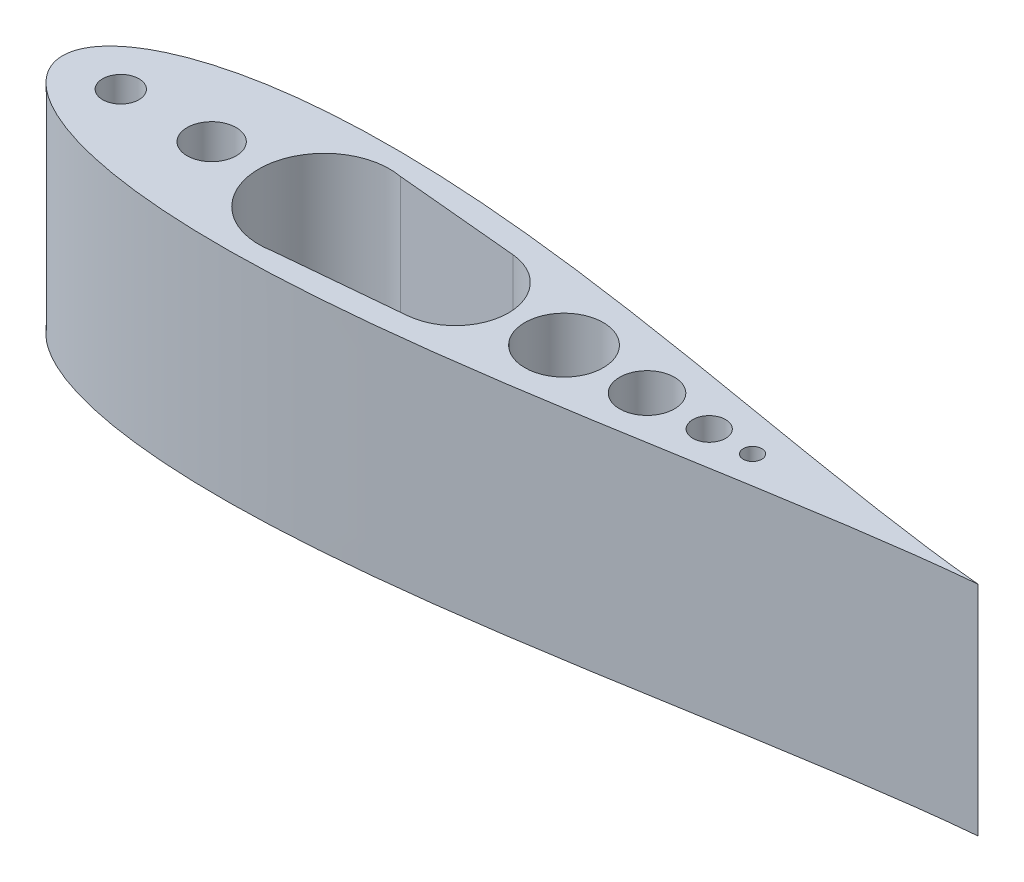
ISO-10303-21;
HEADER;
FILE_DESCRIPTION(('STEP AP214'),'2;1');
FILE_NAME('part.step','',(''),(''),'','','');
FILE_SCHEMA(('AUTOMOTIVE_DESIGN { 1 0 10303 214 1 1 1 1 }'));
ENDSEC;
DATA;
#1=APPLICATION_CONTEXT('core data for automotive mechanical design processes');
#2=APPLICATION_PROTOCOL_DEFINITION('international standard','automotive_design',2000,#1);
#3=PRODUCT_CONTEXT('',#1,'mechanical');
#4=PRODUCT('Part','Part','',(#3));
#5=PRODUCT_RELATED_PRODUCT_CATEGORY('part','',(#4));
#6=PRODUCT_DEFINITION_FORMATION('','',#4);
#7=PRODUCT_DEFINITION_CONTEXT('part definition',#1,'design');
#8=PRODUCT_DEFINITION('design','',#6,#7);
#9=PRODUCT_DEFINITION_SHAPE('','',#8);
#10=(LENGTH_UNIT() NAMED_UNIT(*) SI_UNIT(.MILLI.,.METRE.));
#11=(NAMED_UNIT(*) PLANE_ANGLE_UNIT() SI_UNIT($,.RADIAN.));
#12=(NAMED_UNIT(*) SI_UNIT($,.STERADIAN.) SOLID_ANGLE_UNIT());
#13=UNCERTAINTY_MEASURE_WITH_UNIT(LENGTH_MEASURE(1.E-05),#10,'distance_accuracy_value','');
#14=(GEOMETRIC_REPRESENTATION_CONTEXT(3) GLOBAL_UNCERTAINTY_ASSIGNED_CONTEXT((#13)) GLOBAL_UNIT_ASSIGNED_CONTEXT((#10,
#11,#12)) REPRESENTATION_CONTEXT('',''));
#15=CARTESIAN_POINT('',(0.,0.,0.));
#16=DIRECTION('',(0.,0.,1.));
#17=DIRECTION('',(1.,0.,0.));
#18=AXIS2_PLACEMENT_3D('',#15,#16,#17);
#19=CARTESIAN_POINT('',(-45.5408385930493,50.8,0.));
#20=DIRECTION('',(0.,-1.,0.));
#21=DIRECTION('',(0.,0.,-1.));
#22=AXIS2_PLACEMENT_3D('',#19,#20,#21);
#23=CYLINDRICAL_SURFACE('',#22,15.24);
#24=CARTESIAN_POINT('',(-45.5408385930493,0.,0.));
#25=DIRECTION('',(0.,1.,0.));
#26=DIRECTION('',(0.,0.,1.));
#27=AXIS2_PLACEMENT_3D('',#24,#25,#26);
#28=CIRCLE('',#27,15.24);
#29=CARTESIAN_POINT('',(-42.7235764956563,0.,-14.977337355972));
#30=VERTEX_POINT('',#29);
#31=CARTESIAN_POINT('',(-42.7235764956562,0.,14.9773373559719));
#32=VERTEX_POINT('',#31);
#33=EDGE_CURVE('E156',#30,#32,#28,.T.);
#34=ORIENTED_EDGE('',*,*,#33,.F.);
#35=DIRECTION('',(0.,-1.,0.));
#36=VECTOR('',#35,1.);
#37=CARTESIAN_POINT('',(-42.7235764956563,50.8,-14.977337355972));
#38=LINE('',#37,#36);
#39=CARTESIAN_POINT('',(-42.7235764956563,50.8,-14.977337355972));
#40=VERTEX_POINT('',#39);
#41=EDGE_CURVE('E11',#40,#30,#38,.T.);
#42=ORIENTED_EDGE('',*,*,#41,.F.);
#43=CARTESIAN_POINT('',(-45.5408385930493,50.8,0.));
#44=DIRECTION('',(0.,1.,0.));
#45=DIRECTION('',(0.,0.,1.));
#46=AXIS2_PLACEMENT_3D('',#43,#44,#45);
#47=CIRCLE('',#46,15.24);
#48=CARTESIAN_POINT('',(-42.7235764956562,50.8,14.9773373559719));
#49=VERTEX_POINT('',#48);
#50=EDGE_CURVE('E105',#40,#49,#47,.T.);
#51=ORIENTED_EDGE('',*,*,#50,.T.);
#52=DIRECTION('',(0.,-1.,0.));
#53=VECTOR('',#52,1.);
#54=CARTESIAN_POINT('',(-42.7235764956562,50.8,14.9773373559719));
#55=LINE('',#54,#53);
#56=EDGE_CURVE('E56',#49,#32,#55,.T.);
#57=ORIENTED_EDGE('',*,*,#56,.T.);
#58=EDGE_LOOP('',(#34,#42,#51,#57));
#59=FACE_BOUND('',#58,.T.);
#60=ADVANCED_FACE('F36',(#59),#23,.F.);
#61=CARTESIAN_POINT('',(1.01618101339123,50.8,-10.8993353954501));
#62=DIRECTION('',(0.0928307105141881,0.,-0.995681906627529));
#63=DIRECTION('',(-0.995681906627529,0.,-0.0928307105141881));
#64=AXIS2_PLACEMENT_3D('',#61,#62,#63);
#65=PLANE('',#64);
#66=DIRECTION('',(0.995681906627529,0.,0.0928307105141881));
#67=VECTOR('',#66,1.);
#68=CARTESIAN_POINT('',(1.01618101339123,0.,-10.8993353954501));
#69=LINE('',#68,#67);
#70=CARTESIAN_POINT('',(-13.8473201339051,0.,-12.2851086660576));
#71=VERTEX_POINT('',#70);
#72=EDGE_CURVE('E111',#30,#71,#69,.T.);
#73=ORIENTED_EDGE('',*,*,#72,.T.);
#74=DIRECTION('',(0.,-1.,0.));
#75=VECTOR('',#74,1.);
#76=CARTESIAN_POINT('',(-13.8473201339051,50.8,-12.2851086660576));
#77=LINE('',#76,#75);
#78=CARTESIAN_POINT('',(-13.8473201339051,50.8,-12.2851086660576));
#79=VERTEX_POINT('',#78);
#80=EDGE_CURVE('E47',#79,#71,#77,.T.);
#81=ORIENTED_EDGE('',*,*,#80,.F.);
#82=DIRECTION('',(0.995681906627529,0.,0.0928307105141881));
#83=VECTOR('',#82,1.);
#84=CARTESIAN_POINT('',(1.01618101339123,50.8,-10.8993353954501));
#85=LINE('',#84,#83);
#86=EDGE_CURVE('E98',#40,#79,#85,.T.);
#87=ORIENTED_EDGE('',*,*,#86,.F.);
#88=ORIENTED_EDGE('',*,*,#41,.T.);
#89=EDGE_LOOP('',(#73,#81,#87,#88));
#90=FACE_BOUND('',#89,.T.);
#91=ADVANCED_FACE('F109',(#90),#65,.F.);
#92=CARTESIAN_POINT('',(-14.9927013632145,50.8,0.));
#93=DIRECTION('',(0.,-1.,0.));
#94=DIRECTION('',(0.,0.,-1.));
#95=AXIS2_PLACEMENT_3D('',#92,#93,#94);
#96=CYLINDRICAL_SURFACE('',#95,12.338386973073);
#97=CARTESIAN_POINT('',(-14.9927013632145,0.,0.));
#98=DIRECTION('',(0.,1.,0.));
#99=DIRECTION('',(0.,0.,1.));
#100=AXIS2_PLACEMENT_3D('',#97,#98,#99);
#101=CIRCLE('',#100,12.338386973073);
#102=CARTESIAN_POINT('',(-13.8473201339051,0.,12.2851086660576));
#103=VERTEX_POINT('',#102);
#104=EDGE_CURVE('E159',#103,#71,#101,.T.);
#105=ORIENTED_EDGE('',*,*,#104,.F.);
#106=DIRECTION('',(0.,-1.,0.));
#107=VECTOR('',#106,1.);
#108=CARTESIAN_POINT('',(-13.8473201339051,50.8,12.2851086660576));
#109=LINE('',#108,#107);
#110=CARTESIAN_POINT('',(-13.8473201339051,50.8,12.2851086660576));
#111=VERTEX_POINT('',#110);
#112=EDGE_CURVE('E75',#111,#103,#109,.T.);
#113=ORIENTED_EDGE('',*,*,#112,.F.);
#114=CARTESIAN_POINT('',(-14.9927013632145,50.8,0.));
#115=DIRECTION('',(0.,1.,0.));
#116=DIRECTION('',(0.,0.,1.));
#117=AXIS2_PLACEMENT_3D('',#114,#115,#116);
#118=CIRCLE('',#117,12.338386973073);
#119=EDGE_CURVE('E104',#111,#79,#118,.T.);
#120=ORIENTED_EDGE('',*,*,#119,.T.);
#121=ORIENTED_EDGE('',*,*,#80,.T.);
#122=EDGE_LOOP('',(#105,#113,#120,#121));
#123=FACE_BOUND('',#122,.T.);
#124=ADVANCED_FACE('F115',(#123),#96,.F.);
#125=CARTESIAN_POINT('',(-106.482983395141,50.8,-7.35559204691205E-09));
#126=CARTESIAN_POINT('',(-106.481988205193,50.8,-0.336221446681861));
#127=CARTESIAN_POINT('',(-106.427915569481,50.8,-1.17247085156891));
#128=CARTESIAN_POINT('',(-106.10595146375,50.8,-2.64309926860456));
#129=CARTESIAN_POINT('',(-105.314009735291,50.8,-4.47521740831968));
#130=CARTESIAN_POINT('',(-103.897531118637,50.8,-6.50434841864355));
#131=CARTESIAN_POINT('',(-101.808045378181,50.8,-8.57165133235604));
#132=CARTESIAN_POINT('',(-99.0667178405012,50.8,-10.5675567036547));
#133=CARTESIAN_POINT('',(-95.7198031883871,50.8,-12.4267472996129));
#134=CARTESIAN_POINT('',(-91.8173324289492,50.8,-14.1114417112692));
#135=CARTESIAN_POINT('',(-87.4067018354759,50.8,-15.5993181619853));
#136=CARTESIAN_POINT('',(-82.5319070115307,50.8,-16.8771333229451));
#137=CARTESIAN_POINT('',(-77.2341496539681,50.8,-17.9374356197232));
#138=CARTESIAN_POINT('',(-71.5526070979116,50.8,-18.7767405724213));
#139=CARTESIAN_POINT('',(-65.5251476056233,50.8,-19.3954605858548));
#140=CARTESIAN_POINT('',(-59.188591417565,50.8,-19.7965740301139));
#141=CARTESIAN_POINT('',(-52.5790530798441,50.8,-19.9862763161068));
#142=CARTESIAN_POINT('',(-45.7320019639344,50.8,-19.972865837355));
#143=CARTESIAN_POINT('',(-38.6823636938902,50.8,-19.7673224697509));
#144=CARTESIAN_POINT('',(-31.4645229280415,50.8,-19.3825524779145));
#145=CARTESIAN_POINT('',(-24.1123351486453,50.8,-18.8333174672902));
#146=CARTESIAN_POINT('',(-16.6591158210678,50.8,-18.1360009675589));
#147=CARTESIAN_POINT('',(-9.13763404320438,50.8,-17.3083020166776));
#148=CARTESIAN_POINT('',(-1.58011288129321,50.8,-16.3689060143246));
#149=CARTESIAN_POINT('',(5.98177290974813,50.8,-15.3372135342325));
#150=CARTESIAN_POINT('',(13.5168910285402,50.8,-14.2329994071528));
#151=CARTESIAN_POINT('',(20.9946456094976,50.8,-13.0761298482218));
#152=CARTESIAN_POINT('',(28.3849687391637,50.8,-11.8862100008005));
#153=CARTESIAN_POINT('',(35.6583232509192,50.8,-10.6823363143887));
#154=CARTESIAN_POINT('',(42.7857029072654,50.8,-9.48275912363646));
#155=CARTESIAN_POINT('',(49.7386474254301,50.8,-8.30463778684792));
#156=CARTESIAN_POINT('',(56.4892656841134,50.8,-7.1637607180948));
#157=CARTESIAN_POINT('',(63.0102811144408,50.8,-6.07435669901484));
#158=CARTESIAN_POINT('',(69.2750767276783,50.8,-5.04884141157257));
#159=CARTESIAN_POINT('',(75.257781105611,50.8,-4.09769207062795));
#160=CARTESIAN_POINT('',(80.9333433114544,50.8,-3.2293172488898));
#161=CARTESIAN_POINT('',(86.2776693757116,50.8,-2.44984621283522));
#162=CARTESIAN_POINT('',(91.2676183232589,50.8,-1.76329204938837));
#163=CARTESIAN_POINT('',(95.8816071164014,50.8,-1.17122475958237));
#164=CARTESIAN_POINT('',(100.098099776026,50.8,-0.673119163770976));
#165=CARTESIAN_POINT('',(103.673185129137,50.8,-0.290516392494538));
#166=CARTESIAN_POINT('',(105.83614121967,50.8,-0.0817456538579847));
#167=CARTESIAN_POINT('',(106.733370690552,50.8,-7.30038924277865E-09));
#168=B_SPLINE_CURVE_WITH_KNOTS('',3,(#125,#126,#127,#128,#129,#130,#131,#132,#133,#134,#135,
#136,#137,#138,#139,#140,#141,#142,#143,#144,#145,#146,#147,#148,#149,#150,#151,#152,#153,#154,
#155,#156,#157,#158,#159,#160,#161,#162,#163,#164,#165,#166,#167),.UNSPECIFIED.,.F.,.F.,(4,1,1,
1,1,1,1,1,1,1,1,1,1,1,1,1,1,1,1,1,1,1,1,1,1,1,1,1,1,1,1,1,1,1,1,1,1,1,1,1,4),(0.5,
0.502166768562745,0.505390167385713,0.509655974305835,0.514947681887198,0.521244711429097,
0.528520886222697,0.536744945012688,0.545881360311019,0.555890751085959,0.566730118512969,
0.578352990409744,0.59070958813284,0.603747039427916,0.617409572172202,0.631638768029288,
0.646373793426418,0.66155165817642,0.677107482822761,0.692974771091203,0.709085712601986,
0.725371443301651,0.741762353139131,0.758188398075751,0.774579367488477,0.790865214368963,
0.806976331929698,0.822843867373426,0.838400001999155,0.853578261502887,0.868313774347479,
0.882543568085681,0.896206835422454,0.909245173309164,0.921602869650348,0.933227116385514,
0.944068236336681,0.954079898096736,0.963219316327445,0.971447444986932,0.977251073986684),.UNSPECIFIED.);
#169=DIRECTION('',(0.,-1.,0.));
#170=VECTOR('',#169,1.);
#171=SURFACE_OF_LINEAR_EXTRUSION('',#168,#170);
#172=CARTESIAN_POINT('',(-106.482983395141,0.,-7.35559204691205E-09));
#173=CARTESIAN_POINT('',(-106.481988205193,0.,-0.336221446681861));
#174=CARTESIAN_POINT('',(-106.427915569481,0.,-1.17247085156891));
#175=CARTESIAN_POINT('',(-106.10595146375,0.,-2.64309926860456));
#176=CARTESIAN_POINT('',(-105.314009735291,0.,-4.47521740831968));
#177=CARTESIAN_POINT('',(-103.897531118637,0.,-6.50434841864355));
#178=CARTESIAN_POINT('',(-101.808045378181,0.,-8.57165133235604));
#179=CARTESIAN_POINT('',(-99.0667178405012,0.,-10.5675567036547));
#180=CARTESIAN_POINT('',(-95.7198031883871,0.,-12.4267472996129));
#181=CARTESIAN_POINT('',(-91.8173324289492,0.,-14.1114417112692));
#182=CARTESIAN_POINT('',(-87.4067018354759,0.,-15.5993181619853));
#183=CARTESIAN_POINT('',(-82.5319070115307,0.,-16.8771333229451));
#184=CARTESIAN_POINT('',(-77.2341496539681,0.,-17.9374356197232));
#185=CARTESIAN_POINT('',(-71.5526070979116,0.,-18.7767405724213));
#186=CARTESIAN_POINT('',(-65.5251476056233,0.,-19.3954605858548));
#187=CARTESIAN_POINT('',(-59.188591417565,0.,-19.7965740301139));
#188=CARTESIAN_POINT('',(-52.5790530798441,0.,-19.9862763161068));
#189=CARTESIAN_POINT('',(-45.7320019639344,0.,-19.972865837355));
#190=CARTESIAN_POINT('',(-38.6823636938902,0.,-19.7673224697509));
#191=CARTESIAN_POINT('',(-31.4645229280415,0.,-19.3825524779145));
#192=CARTESIAN_POINT('',(-24.1123351486453,0.,-18.8333174672902));
#193=CARTESIAN_POINT('',(-16.6591158210678,0.,-18.1360009675589));
#194=CARTESIAN_POINT('',(-9.13763404320438,0.,-17.3083020166776));
#195=CARTESIAN_POINT('',(-1.58011288129321,0.,-16.3689060143246));
#196=CARTESIAN_POINT('',(5.98177290974813,0.,-15.3372135342325));
#197=CARTESIAN_POINT('',(13.5168910285402,0.,-14.2329994071528));
#198=CARTESIAN_POINT('',(20.9946456094976,0.,-13.0761298482218));
#199=CARTESIAN_POINT('',(28.3849687391637,0.,-11.8862100008005));
#200=CARTESIAN_POINT('',(35.6583232509192,0.,-10.6823363143887));
#201=CARTESIAN_POINT('',(42.7857029072654,0.,-9.48275912363646));
#202=CARTESIAN_POINT('',(49.7386474254301,0.,-8.30463778684792));
#203=CARTESIAN_POINT('',(56.4892656841134,0.,-7.1637607180948));
#204=CARTESIAN_POINT('',(63.0102811144408,0.,-6.07435669901484));
#205=CARTESIAN_POINT('',(69.2750767276783,0.,-5.04884141157257));
#206=CARTESIAN_POINT('',(75.257781105611,0.,-4.09769207062795));
#207=CARTESIAN_POINT('',(80.9333433114544,0.,-3.2293172488898));
#208=CARTESIAN_POINT('',(86.2776693757116,0.,-2.44984621283522));
#209=CARTESIAN_POINT('',(91.2676183232589,0.,-1.76329204938837));
#210=CARTESIAN_POINT('',(95.8816071164014,0.,-1.17122475958237));
#211=CARTESIAN_POINT('',(100.098099776026,0.,-0.673119163770976));
#212=CARTESIAN_POINT('',(103.673185129137,0.,-0.290516392494538));
#213=CARTESIAN_POINT('',(105.83614121967,0.,-0.0817456538579847));
#214=CARTESIAN_POINT('',(106.733370690552,0.,-7.30038924277865E-09));
#215=B_SPLINE_CURVE_WITH_KNOTS('',3,(#172,#173,#174,#175,#176,#177,#178,#179,#180,#181,#182,
#183,#184,#185,#186,#187,#188,#189,#190,#191,#192,#193,#194,#195,#196,#197,#198,#199,#200,#201,
#202,#203,#204,#205,#206,#207,#208,#209,#210,#211,#212,#213,#214),.UNSPECIFIED.,.F.,.F.,(4,1,1,
1,1,1,1,1,1,1,1,1,1,1,1,1,1,1,1,1,1,1,1,1,1,1,1,1,1,1,1,1,1,1,1,1,1,1,1,1,4),(0.5,
0.502166768562745,0.505390167385713,0.509655974305835,0.514947681887198,0.521244711429097,
0.528520886222697,0.536744945012688,0.545881360311019,0.555890751085959,0.566730118512969,
0.578352990409744,0.59070958813284,0.603747039427916,0.617409572172202,0.631638768029288,
0.646373793426418,0.66155165817642,0.677107482822761,0.692974771091203,0.709085712601986,
0.725371443301651,0.741762353139131,0.758188398075751,0.774579367488477,0.790865214368963,
0.806976331929698,0.822843867373426,0.838400001999155,0.853578261502887,0.868313774347479,
0.882543568085681,0.896206835422454,0.909245173309164,0.921602869650348,0.933227116385514,
0.944068236336681,0.954079898096736,0.963219316327445,0.971447444986932,0.977251073986684),.UNSPECIFIED.);
#216=CARTESIAN_POINT('',(-106.482983395141,0.,-7.35559204691205E-09));
#217=VERTEX_POINT('',#216);
#218=CARTESIAN_POINT('',(106.733370690552,0.,7.30033930074721E-09));
#219=VERTEX_POINT('',#218);
#220=EDGE_CURVE('E134',#217,#219,#215,.T.);
#221=ORIENTED_EDGE('',*,*,#220,.F.);
#222=DIRECTION('',(0.,-1.,0.));
#223=VECTOR('',#222,1.);
#224=CARTESIAN_POINT('',(-106.482983395141,50.8,-7.35559204691205E-09));
#225=LINE('',#224,#223);
#226=CARTESIAN_POINT('',(-106.482983395141,50.8,-7.35559204691205E-09));
#227=VERTEX_POINT('',#226);
#228=EDGE_CURVE('E41',#227,#217,#225,.T.);
#229=ORIENTED_EDGE('',*,*,#228,.F.);
#230=CARTESIAN_POINT('',(106.733370690552,50.8,7.30033930074721E-09));
#231=VERTEX_POINT('',#230);
#232=EDGE_CURVE('E176',#227,#231,#168,.T.);
#233=ORIENTED_EDGE('',*,*,#232,.T.);
#234=DIRECTION('',(0.,-1.,0.));
#235=VECTOR('',#234,1.);
#236=CARTESIAN_POINT('',(106.733370690552,50.8,7.30033930074721E-09));
#237=LINE('',#236,#235);
#238=EDGE_CURVE('E133',#231,#219,#237,.T.);
#239=ORIENTED_EDGE('',*,*,#238,.T.);
#240=EDGE_LOOP('',(#221,#229,#233,#239));
#241=FACE_BOUND('',#240,.T.);
#242=ADVANCED_FACE('F38',(#241),#171,.T.);
#243=CARTESIAN_POINT('',(44.126269566956,50.8,0.));
#244=DIRECTION('',(0.,-1.,0.));
#245=DIRECTION('',(0.,0.,-1.));
#246=AXIS2_PLACEMENT_3D('',#243,#244,#245);
#247=CYLINDRICAL_SURFACE('',#246,3.80999999961901);
#248=CARTESIAN_POINT('',(44.126269566956,50.8,0.));
#249=DIRECTION('',(0.,1.,0.));
#250=DIRECTION('',(0.,0.,1.));
#251=AXIS2_PLACEMENT_3D('',#248,#249,#250);
#252=CIRCLE('',#251,3.80999999961901);
#253=CARTESIAN_POINT('',(44.126269566956,50.8,3.80999999961899));
#254=VERTEX_POINT('',#253);
#255=EDGE_CURVE('E127',#254,#254,#252,.T.);
#256=ORIENTED_EDGE('',*,*,#255,.T.);
#257=EDGE_LOOP('',(#256));
#258=FACE_BOUND('',#257,.T.);
#259=CARTESIAN_POINT('',(44.126269566956,0.,0.));
#260=DIRECTION('',(0.,1.,0.));
#261=DIRECTION('',(0.,0.,1.));
#262=AXIS2_PLACEMENT_3D('',#259,#260,#261);
#263=CIRCLE('',#262,3.80999999961901);
#264=CARTESIAN_POINT('',(44.126269566956,0.,3.80999999961899));
#265=VERTEX_POINT('',#264);
#266=EDGE_CURVE('E170',#265,#265,#263,.T.);
#267=ORIENTED_EDGE('',*,*,#266,.F.);
#268=EDGE_LOOP('',(#267));
#269=FACE_BOUND('',#268,.T.);
#270=ADVANCED_FACE('F188',(#258,#269),#247,.F.);
#271=CARTESIAN_POINT('',(29.6435174290047,50.8,0.));
#272=DIRECTION('',(0.,-1.,0.));
#273=DIRECTION('',(0.,0.,-1.));
#274=AXIS2_PLACEMENT_3D('',#271,#272,#273);
#275=CYLINDRICAL_SURFACE('',#274,6.39233333269412);
#276=CARTESIAN_POINT('',(29.6435174290047,50.8,0.));
#277=DIRECTION('',(0.,1.,0.));
#278=DIRECTION('',(0.,0.,1.));
#279=AXIS2_PLACEMENT_3D('',#276,#277,#278);
#280=CIRCLE('',#279,6.39233333269412);
#281=CARTESIAN_POINT('',(29.6435174290047,50.8,6.3923333326941));
#282=VERTEX_POINT('',#281);
#283=EDGE_CURVE('E124',#282,#282,#280,.T.);
#284=ORIENTED_EDGE('',*,*,#283,.T.);
#285=EDGE_LOOP('',(#284));
#286=FACE_BOUND('',#285,.T.);
#287=CARTESIAN_POINT('',(29.6435174290047,0.,0.));
#288=DIRECTION('',(0.,1.,0.));
#289=DIRECTION('',(0.,0.,1.));
#290=AXIS2_PLACEMENT_3D('',#287,#288,#289);
#291=CIRCLE('',#290,6.39233333269412);
#292=CARTESIAN_POINT('',(29.6435174290047,0.,6.3923333326941));
#293=VERTEX_POINT('',#292);
#294=EDGE_CURVE('E167',#293,#293,#291,.T.);
#295=ORIENTED_EDGE('',*,*,#294,.F.);
#296=EDGE_LOOP('',(#295));
#297=FACE_BOUND('',#296,.T.);
#298=ADVANCED_FACE('F193',(#286,#297),#275,.F.);
#299=CARTESIAN_POINT('',(10.3101726344375,50.8,0.));
#300=DIRECTION('',(0.,-1.,0.));
#301=DIRECTION('',(0.,0.,-1.));
#302=AXIS2_PLACEMENT_3D('',#299,#300,#301);
#303=CYLINDRICAL_SURFACE('',#302,9.13101146225404);
#304=CARTESIAN_POINT('',(10.3101726344375,50.8,0.));
#305=DIRECTION('',(0.,1.,0.));
#306=DIRECTION('',(0.,0.,1.));
#307=AXIS2_PLACEMENT_3D('',#304,#305,#306);
#308=CIRCLE('',#307,9.13101146225404);
#309=CARTESIAN_POINT('',(10.3101726344375,50.8,9.13101146225402));
#310=VERTEX_POINT('',#309);
#311=EDGE_CURVE('E118',#310,#310,#308,.T.);
#312=ORIENTED_EDGE('',*,*,#311,.T.);
#313=EDGE_LOOP('',(#312));
#314=FACE_BOUND('',#313,.T.);
#315=CARTESIAN_POINT('',(10.3101726344375,0.,0.));
#316=DIRECTION('',(0.,1.,0.));
#317=DIRECTION('',(0.,0.,1.));
#318=AXIS2_PLACEMENT_3D('',#315,#316,#317);
#319=CIRCLE('',#318,9.13101146225404);
#320=CARTESIAN_POINT('',(10.3101726344375,0.,9.13101146225402));
#321=VERTEX_POINT('',#320);
#322=EDGE_CURVE('E164',#321,#321,#319,.T.);
#323=ORIENTED_EDGE('',*,*,#322,.F.);
#324=EDGE_LOOP('',(#323));
#325=FACE_BOUND('',#324,.T.);
#326=ADVANCED_FACE('F231',(#314,#325),#303,.F.);
#327=CARTESIAN_POINT('',(1.01618101339123,50.8,10.8993353954501));
#328=DIRECTION('',(-0.0928307105141884,0.,-0.995681906627529));
#329=DIRECTION('',(-0.995681906627529,0.,0.0928307105141884));
#330=AXIS2_PLACEMENT_3D('',#327,#328,#329);
#331=PLANE('',#330);
#332=DIRECTION('',(0.995681906627529,0.,-0.0928307105141884));
#333=VECTOR('',#332,1.);
#334=CARTESIAN_POINT('',(1.01618101339123,0.,10.8993353954501));
#335=LINE('',#334,#333);
#336=EDGE_CURVE('E161',#32,#103,#335,.T.);
#337=ORIENTED_EDGE('',*,*,#336,.F.);
#338=ORIENTED_EDGE('',*,*,#56,.F.);
#339=DIRECTION('',(0.995681906627529,0.,-0.0928307105141884));
#340=VECTOR('',#339,1.);
#341=CARTESIAN_POINT('',(1.01618101339123,50.8,10.8993353954501));
#342=LINE('',#341,#340);
#343=EDGE_CURVE('E116',#49,#111,#342,.T.);
#344=ORIENTED_EDGE('',*,*,#343,.T.);
#345=ORIENTED_EDGE('',*,*,#112,.T.);
#346=EDGE_LOOP('',(#337,#338,#344,#345));
#347=FACE_BOUND('',#346,.T.);
#348=ADVANCED_FACE('F208',(#347),#331,.T.);
#349=CARTESIAN_POINT('',(-71.7704466196341,50.8,0.));
#350=DIRECTION('',(0.,-1.,0.));
#351=DIRECTION('',(0.,0.,-1.));
#352=AXIS2_PLACEMENT_3D('',#349,#350,#351);
#353=CYLINDRICAL_SURFACE('',#352,5.71499999999999);
#354=CARTESIAN_POINT('',(-71.7704466196341,50.8,0.));
#355=DIRECTION('',(0.,1.,0.));
#356=DIRECTION('',(0.,0.,1.));
#357=AXIS2_PLACEMENT_3D('',#354,#355,#356);
#358=CIRCLE('',#357,5.71499999999999);
#359=CARTESIAN_POINT('',(-71.7704466196341,50.8,5.71499999999999));
#360=VERTEX_POINT('',#359);
#361=EDGE_CURVE('E228',#360,#360,#358,.T.);
#362=ORIENTED_EDGE('',*,*,#361,.T.);
#363=EDGE_LOOP('',(#362));
#364=FACE_BOUND('',#363,.T.);
#365=CARTESIAN_POINT('',(-71.7704466196341,0.,0.));
#366=DIRECTION('',(0.,1.,0.));
#367=DIRECTION('',(0.,0.,1.));
#368=AXIS2_PLACEMENT_3D('',#365,#366,#367);
#369=CIRCLE('',#368,5.71499999999999);
#370=CARTESIAN_POINT('',(-71.7704466196341,0.,5.71499999999999));
#371=VERTEX_POINT('',#370);
#372=EDGE_CURVE('E153',#371,#371,#369,.T.);
#373=ORIENTED_EDGE('',*,*,#372,.F.);
#374=EDGE_LOOP('',(#373));
#375=FACE_BOUND('',#374,.T.);
#376=ADVANCED_FACE('F204',(#364,#375),#353,.F.);
#377=CARTESIAN_POINT('',(-92.9371132841841,50.8,0.));
#378=DIRECTION('',(0.,-1.,0.));
#379=DIRECTION('',(0.,0.,-1.));
#380=AXIS2_PLACEMENT_3D('',#377,#378,#379);
#381=CYLINDRICAL_SURFACE('',#380,4.23333333291002);
#382=CARTESIAN_POINT('',(-92.9371132841841,50.8,0.));
#383=DIRECTION('',(0.,1.,0.));
#384=DIRECTION('',(0.,0.,1.));
#385=AXIS2_PLACEMENT_3D('',#382,#383,#384);
#386=CIRCLE('',#385,4.23333333291002);
#387=CARTESIAN_POINT('',(-92.9371132841841,50.8,4.23333333291002));
#388=VERTEX_POINT('',#387);
#389=EDGE_CURVE('E219',#388,#388,#386,.T.);
#390=ORIENTED_EDGE('',*,*,#389,.T.);
#391=EDGE_LOOP('',(#390));
#392=FACE_BOUND('',#391,.T.);
#393=CARTESIAN_POINT('',(-92.9371132841841,0.,0.));
#394=DIRECTION('',(0.,1.,0.));
#395=DIRECTION('',(0.,0.,1.));
#396=AXIS2_PLACEMENT_3D('',#393,#394,#395);
#397=CIRCLE('',#396,4.23333333291002);
#398=CARTESIAN_POINT('',(-92.9371132841841,0.,4.23333333291002));
#399=VERTEX_POINT('',#398);
#400=EDGE_CURVE('E147',#399,#399,#397,.T.);
#401=ORIENTED_EDGE('',*,*,#400,.F.);
#402=EDGE_LOOP('',(#401));
#403=FACE_BOUND('',#402,.T.);
#404=ADVANCED_FACE('F207',(#392,#403),#381,.F.);
#405=CARTESIAN_POINT('',(-106.4829833948,50.8,7.35559432782563E-09));
#406=CARTESIAN_POINT('',(-106.481988204852,50.8,0.336221446681325));
#407=CARTESIAN_POINT('',(-106.42791556914,50.8,1.17247085156703));
#408=CARTESIAN_POINT('',(-106.105951463409,50.8,2.64309926860033));
#409=CARTESIAN_POINT('',(-105.314009734951,50.8,4.47521740831253));
#410=CARTESIAN_POINT('',(-103.8975311183,50.8,6.50434841863314));
#411=CARTESIAN_POINT('',(-101.808045377848,50.8,8.57165133234234));
#412=CARTESIAN_POINT('',(-99.0667178401719,50.8,10.5675567036378));
#413=CARTESIAN_POINT('',(-95.7198031880631,50.8,12.426747299593));
#414=CARTESIAN_POINT('',(-91.8173324286315,50.8,14.1114417112466));
#415=CARTESIAN_POINT('',(-87.4067018351652,50.8,15.5993181619603));
#416=CARTESIAN_POINT('',(-82.5319070112279,50.8,16.877133322918));
#417=CARTESIAN_POINT('',(-77.2341496536738,50.8,17.9374356196945));
#418=CARTESIAN_POINT('',(-71.5526070976263,50.8,18.7767405723913));
#419=CARTESIAN_POINT('',(-65.5251476053477,50.8,19.3954605858237));
#420=CARTESIAN_POINT('',(-59.1885914172995,50.8,19.7965740300822));
#421=CARTESIAN_POINT('',(-52.5790530795892,50.8,19.9862763160748));
#422=CARTESIAN_POINT('',(-45.7320019636904,50.8,19.972865837323));
#423=CARTESIAN_POINT('',(-38.6823636936575,50.8,19.7673224697192));
#424=CARTESIAN_POINT('',(-31.4645229278204,50.8,19.3825524778835));
#425=CARTESIAN_POINT('',(-24.112335148436,50.8,18.8333174672601));
#426=CARTESIAN_POINT('',(-16.6591158208704,50.8,18.1360009675299));
#427=CARTESIAN_POINT('',(-9.13763404301895,50.8,17.3083020166499));
#428=CARTESIAN_POINT('',(-1.58011288111988,50.8,16.3689060142984));
#429=CARTESIAN_POINT('',(5.98177290990936,50.8,15.337213534208));
#430=CARTESIAN_POINT('',(13.5168910286894,50.8,14.23299940713));
#431=CARTESIAN_POINT('',(20.9946456096348,50.8,13.0761298482009));
#432=CARTESIAN_POINT('',(28.3849687392891,50.8,11.8862100007814));
#433=CARTESIAN_POINT('',(35.6583232510329,50.8,10.6823363143715));
#434=CARTESIAN_POINT('',(42.7857029073677,50.8,9.48275912362124));
#435=CARTESIAN_POINT('',(49.7386474255213,50.8,8.30463778683458));
#436=CARTESIAN_POINT('',(56.4892656841938,50.8,7.16376071808329));
#437=CARTESIAN_POINT('',(63.0102811145106,50.8,6.07435669900507));
#438=CARTESIAN_POINT('',(69.2750767277382,50.8,5.04884141156445));
#439=CARTESIAN_POINT('',(75.2577811056613,50.8,4.09769207062136));
#440=CARTESIAN_POINT('',(80.9333433114957,50.8,3.22931724888459));
#441=CARTESIAN_POINT('',(86.2776693757443,50.8,2.44984621283126));
#442=CARTESIAN_POINT('',(91.2676183232836,50.8,1.7632920493855));
#443=CARTESIAN_POINT('',(95.8816071164188,50.8,1.17122475958044));
#444=CARTESIAN_POINT('',(100.098099776037,50.8,0.67311916376985));
#445=CARTESIAN_POINT('',(103.673185129142,50.8,0.290516392494014));
#446=CARTESIAN_POINT('',(105.836141219672,50.8,0.0817456538578038));
#447=CARTESIAN_POINT('',(106.733370690552,50.8,7.30033930074721E-09));
#448=B_SPLINE_CURVE_WITH_KNOTS('',3,(#405,#406,#407,#408,#409,#410,#411,#412,#413,#414,#415,
#416,#417,#418,#419,#420,#421,#422,#423,#424,#425,#426,#427,#428,#429,#430,#431,#432,#433,#434,
#435,#436,#437,#438,#439,#440,#441,#442,#443,#444,#445,#446,#447),.UNSPECIFIED.,.F.,.F.,(4,1,1,
1,1,1,1,1,1,1,1,1,1,1,1,1,1,1,1,1,1,1,1,1,1,1,1,1,1,1,1,1,1,1,1,1,1,1,1,1,4),(0.5,
0.502166768562745,0.505390167385713,0.509655974305835,0.514947681887198,0.521244711429097,
0.528520886222697,0.536744945012688,0.545881360311019,0.555890751085959,0.566730118512969,
0.578352990409744,0.59070958813284,0.603747039427916,0.617409572172202,0.631638768029288,
0.646373793426418,0.66155165817642,0.677107482822761,0.692974771091203,0.709085712601986,
0.725371443301651,0.741762353139131,0.758188398075751,0.774579367488477,0.790865214368963,
0.806976331929698,0.822843867373426,0.838400001999155,0.853578261502887,0.868313774347479,
0.882543568085681,0.896206835422454,0.909245173309164,0.921602869650348,0.933227116385514,
0.944068236336681,0.954079898096736,0.963219316327445,0.971447444986932,0.977251073986684),.UNSPECIFIED.);
#449=DIRECTION('',(0.,-1.,0.));
#450=VECTOR('',#449,1.);
#451=SURFACE_OF_LINEAR_EXTRUSION('',#448,#450);
#452=CARTESIAN_POINT('',(-106.4829833948,0.,7.35559432782563E-09));
#453=CARTESIAN_POINT('',(-106.481988204852,0.,0.336221446681325));
#454=CARTESIAN_POINT('',(-106.42791556914,0.,1.17247085156703));
#455=CARTESIAN_POINT('',(-106.105951463409,0.,2.64309926860033));
#456=CARTESIAN_POINT('',(-105.314009734951,0.,4.47521740831253));
#457=CARTESIAN_POINT('',(-103.8975311183,0.,6.50434841863314));
#458=CARTESIAN_POINT('',(-101.808045377848,0.,8.57165133234234));
#459=CARTESIAN_POINT('',(-99.0667178401719,0.,10.5675567036378));
#460=CARTESIAN_POINT('',(-95.7198031880631,0.,12.426747299593));
#461=CARTESIAN_POINT('',(-91.8173324286315,0.,14.1114417112466));
#462=CARTESIAN_POINT('',(-87.4067018351652,0.,15.5993181619603));
#463=CARTESIAN_POINT('',(-82.5319070112279,0.,16.877133322918));
#464=CARTESIAN_POINT('',(-77.2341496536738,0.,17.9374356196945));
#465=CARTESIAN_POINT('',(-71.5526070976263,0.,18.7767405723913));
#466=CARTESIAN_POINT('',(-65.5251476053477,0.,19.3954605858237));
#467=CARTESIAN_POINT('',(-59.1885914172995,0.,19.7965740300822));
#468=CARTESIAN_POINT('',(-52.5790530795892,0.,19.9862763160748));
#469=CARTESIAN_POINT('',(-45.7320019636904,0.,19.972865837323));
#470=CARTESIAN_POINT('',(-38.6823636936575,0.,19.7673224697192));
#471=CARTESIAN_POINT('',(-31.4645229278204,0.,19.3825524778835));
#472=CARTESIAN_POINT('',(-24.112335148436,0.,18.8333174672601));
#473=CARTESIAN_POINT('',(-16.6591158208704,0.,18.1360009675299));
#474=CARTESIAN_POINT('',(-9.13763404301895,0.,17.3083020166499));
#475=CARTESIAN_POINT('',(-1.58011288111988,0.,16.3689060142984));
#476=CARTESIAN_POINT('',(5.98177290990936,0.,15.337213534208));
#477=CARTESIAN_POINT('',(13.5168910286894,0.,14.23299940713));
#478=CARTESIAN_POINT('',(20.9946456096348,0.,13.0761298482009));
#479=CARTESIAN_POINT('',(28.3849687392891,0.,11.8862100007814));
#480=CARTESIAN_POINT('',(35.6583232510329,0.,10.6823363143715));
#481=CARTESIAN_POINT('',(42.7857029073677,0.,9.48275912362124));
#482=CARTESIAN_POINT('',(49.7386474255213,0.,8.30463778683458));
#483=CARTESIAN_POINT('',(56.4892656841938,0.,7.16376071808329));
#484=CARTESIAN_POINT('',(63.0102811145106,0.,6.07435669900507));
#485=CARTESIAN_POINT('',(69.2750767277382,0.,5.04884141156445));
#486=CARTESIAN_POINT('',(75.2577811056613,0.,4.09769207062136));
#487=CARTESIAN_POINT('',(80.9333433114957,0.,3.22931724888459));
#488=CARTESIAN_POINT('',(86.2776693757443,0.,2.44984621283126));
#489=CARTESIAN_POINT('',(91.2676183232836,0.,1.7632920493855));
#490=CARTESIAN_POINT('',(95.8816071164188,0.,1.17122475958044));
#491=CARTESIAN_POINT('',(100.098099776037,0.,0.67311916376985));
#492=CARTESIAN_POINT('',(103.673185129142,0.,0.290516392494014));
#493=CARTESIAN_POINT('',(105.836141219672,0.,0.0817456538578038));
#494=CARTESIAN_POINT('',(106.733370690552,0.,7.30033930074721E-09));
#495=B_SPLINE_CURVE_WITH_KNOTS('',3,(#452,#453,#454,#455,#456,#457,#458,#459,#460,#461,#462,
#463,#464,#465,#466,#467,#468,#469,#470,#471,#472,#473,#474,#475,#476,#477,#478,#479,#480,#481,
#482,#483,#484,#485,#486,#487,#488,#489,#490,#491,#492,#493,#494),.UNSPECIFIED.,.F.,.F.,(4,1,1,
1,1,1,1,1,1,1,1,1,1,1,1,1,1,1,1,1,1,1,1,1,1,1,1,1,1,1,1,1,1,1,1,1,1,1,1,1,4),(0.5,
0.502166768562745,0.505390167385713,0.509655974305835,0.514947681887198,0.521244711429097,
0.528520886222697,0.536744945012688,0.545881360311019,0.555890751085959,0.566730118512969,
0.578352990409744,0.59070958813284,0.603747039427916,0.617409572172202,0.631638768029288,
0.646373793426418,0.66155165817642,0.677107482822761,0.692974771091203,0.709085712601986,
0.725371443301651,0.741762353139131,0.758188398075751,0.774579367488477,0.790865214368963,
0.806976331929698,0.822843867373426,0.838400001999155,0.853578261502887,0.868313774347479,
0.882543568085681,0.896206835422454,0.909245173309164,0.921602869650348,0.933227116385514,
0.944068236336681,0.954079898096736,0.963219316327445,0.971447444986932,0.977251073986684),.UNSPECIFIED.);
#496=EDGE_CURVE('E139',#217,#219,#495,.T.);
#497=ORIENTED_EDGE('',*,*,#496,.T.);
#498=ORIENTED_EDGE('',*,*,#238,.F.);
#499=EDGE_CURVE('E182',#227,#231,#448,.T.);
#500=ORIENTED_EDGE('',*,*,#499,.F.);
#501=ORIENTED_EDGE('',*,*,#228,.T.);
#502=EDGE_LOOP('',(#497,#498,#500,#501));
#503=FACE_BOUND('',#502,.T.);
#504=ADVANCED_FACE('F181',(#503),#451,.F.);
#505=CARTESIAN_POINT('',(54.2103982242517,50.8,0.));
#506=DIRECTION('',(0.,-1.,0.));
#507=DIRECTION('',(0.,0.,-1.));
#508=AXIS2_PLACEMENT_3D('',#505,#506,#507);
#509=CYLINDRICAL_SURFACE('',#508,2.15899999978409);
#510=CARTESIAN_POINT('',(54.2103982242517,50.8,0.));
#511=DIRECTION('',(0.,1.,0.));
#512=DIRECTION('',(0.,0.,1.));
#513=AXIS2_PLACEMENT_3D('',#510,#511,#512);
#514=CIRCLE('',#513,2.15899999978409);
#515=CARTESIAN_POINT('',(54.2103982242517,50.8,2.15899999978407));
#516=VERTEX_POINT('',#515);
#517=EDGE_CURVE('E130',#516,#516,#514,.T.);
#518=ORIENTED_EDGE('',*,*,#517,.T.);
#519=EDGE_LOOP('',(#518));
#520=FACE_BOUND('',#519,.T.);
#521=CARTESIAN_POINT('',(54.2103982242517,0.,0.));
#522=DIRECTION('',(0.,1.,0.));
#523=DIRECTION('',(0.,0.,1.));
#524=AXIS2_PLACEMENT_3D('',#521,#522,#523);
#525=CIRCLE('',#524,2.15899999978409);
#526=CARTESIAN_POINT('',(54.2103982242517,0.,2.15899999978407));
#527=VERTEX_POINT('',#526);
#528=EDGE_CURVE('E173',#527,#527,#525,.T.);
#529=ORIENTED_EDGE('',*,*,#528,.F.);
#530=EDGE_LOOP('',(#529));
#531=FACE_BOUND('',#530,.T.);
#532=ADVANCED_FACE('F214',(#520,#531),#509,.F.);
#533=CARTESIAN_POINT('',(0.,50.8,0.));
#534=DIRECTION('',(0.,1.,0.));
#535=DIRECTION('',(0.,0.,1.));
#536=AXIS2_PLACEMENT_3D('',#533,#534,#535);
#537=PLANE('',#536);
#538=ORIENTED_EDGE('',*,*,#232,.F.);
#539=ORIENTED_EDGE('',*,*,#499,.T.);
#540=EDGE_LOOP('',(#538,#539));
#541=FACE_BOUND('',#540,.T.);
#542=ORIENTED_EDGE('',*,*,#389,.F.);
#543=EDGE_LOOP('',(#542));
#544=FACE_BOUND('',#543,.T.);
#545=ORIENTED_EDGE('',*,*,#361,.F.);
#546=EDGE_LOOP('',(#545));
#547=FACE_BOUND('',#546,.T.);
#548=ORIENTED_EDGE('',*,*,#50,.F.);
#549=ORIENTED_EDGE('',*,*,#86,.T.);
#550=ORIENTED_EDGE('',*,*,#119,.F.);
#551=ORIENTED_EDGE('',*,*,#343,.F.);
#552=EDGE_LOOP('',(#548,#549,#550,#551));
#553=FACE_BOUND('',#552,.T.);
#554=ORIENTED_EDGE('',*,*,#311,.F.);
#555=EDGE_LOOP('',(#554));
#556=FACE_BOUND('',#555,.T.);
#557=ORIENTED_EDGE('',*,*,#283,.F.);
#558=EDGE_LOOP('',(#557));
#559=FACE_BOUND('',#558,.T.);
#560=ORIENTED_EDGE('',*,*,#255,.F.);
#561=EDGE_LOOP('',(#560));
#562=FACE_BOUND('',#561,.T.);
#563=ORIENTED_EDGE('',*,*,#517,.F.);
#564=EDGE_LOOP('',(#563));
#565=FACE_BOUND('',#564,.T.);
#566=ADVANCED_FACE('F100',(#541,#544,#547,#553,#556,#559,#562,#565),#537,.T.);
#567=CARTESIAN_POINT('',(0.,0.,0.));
#568=DIRECTION('',(0.,1.,0.));
#569=DIRECTION('',(0.,0.,1.));
#570=AXIS2_PLACEMENT_3D('',#567,#568,#569);
#571=PLANE('',#570);
#572=ORIENTED_EDGE('',*,*,#220,.T.);
#573=ORIENTED_EDGE('',*,*,#496,.F.);
#574=EDGE_LOOP('',(#572,#573));
#575=FACE_BOUND('',#574,.T.);
#576=ORIENTED_EDGE('',*,*,#400,.T.);
#577=EDGE_LOOP('',(#576));
#578=FACE_BOUND('',#577,.T.);
#579=ORIENTED_EDGE('',*,*,#372,.T.);
#580=EDGE_LOOP('',(#579));
#581=FACE_BOUND('',#580,.T.);
#582=ORIENTED_EDGE('',*,*,#33,.T.);
#583=ORIENTED_EDGE('',*,*,#336,.T.);
#584=ORIENTED_EDGE('',*,*,#104,.T.);
#585=ORIENTED_EDGE('',*,*,#72,.F.);
#586=EDGE_LOOP('',(#582,#583,#584,#585));
#587=FACE_BOUND('',#586,.T.);
#588=ORIENTED_EDGE('',*,*,#322,.T.);
#589=EDGE_LOOP('',(#588));
#590=FACE_BOUND('',#589,.T.);
#591=ORIENTED_EDGE('',*,*,#294,.T.);
#592=EDGE_LOOP('',(#591));
#593=FACE_BOUND('',#592,.T.);
#594=ORIENTED_EDGE('',*,*,#266,.T.);
#595=EDGE_LOOP('',(#594));
#596=FACE_BOUND('',#595,.T.);
#597=ORIENTED_EDGE('',*,*,#528,.T.);
#598=EDGE_LOOP('',(#597));
#599=FACE_BOUND('',#598,.T.);
#600=ADVANCED_FACE('F185',(#575,#578,#581,#587,#590,#593,#596,#599),#571,.F.);
#601=CLOSED_SHELL('',(#60,#91,#124,#242,#270,#298,#326,#348,#376,#404,#504,#532,#566,#600));
#602=MANIFOLD_SOLID_BREP('B2',#601);
#603=ADVANCED_BREP_SHAPE_REPRESENTATION('',(#18,#602),#14);
#604=SHAPE_DEFINITION_REPRESENTATION(#9,#603);
ENDSEC;
END-ISO-10303-21;
